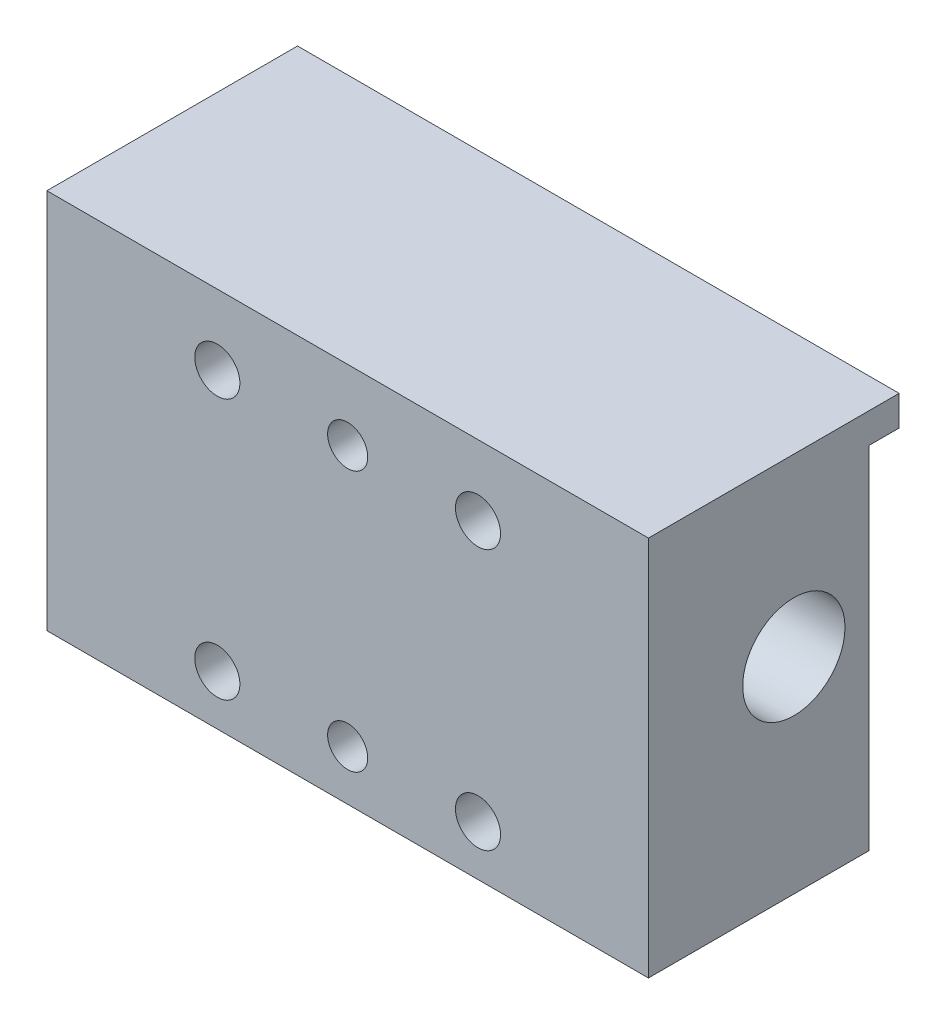
ISO-10303-21;
HEADER;
FILE_DESCRIPTION(('STEP AP214'),'2;1');
FILE_NAME('part.step','',(''),(''),'','','');
FILE_SCHEMA(('AUTOMOTIVE_DESIGN { 1 0 10303 214 1 1 1 1 }'));
ENDSEC;
DATA;
#1=APPLICATION_CONTEXT('core data for automotive mechanical design processes');
#2=APPLICATION_PROTOCOL_DEFINITION('international standard','automotive_design',2000,#1);
#3=PRODUCT_CONTEXT('',#1,'mechanical');
#4=PRODUCT('Part','Part','',(#3));
#5=PRODUCT_RELATED_PRODUCT_CATEGORY('part','',(#4));
#6=PRODUCT_DEFINITION_FORMATION('','',#4);
#7=PRODUCT_DEFINITION_CONTEXT('part definition',#1,'design');
#8=PRODUCT_DEFINITION('design','',#6,#7);
#9=PRODUCT_DEFINITION_SHAPE('','',#8);
#10=(LENGTH_UNIT() NAMED_UNIT(*) SI_UNIT(.MILLI.,.METRE.));
#11=(NAMED_UNIT(*) PLANE_ANGLE_UNIT() SI_UNIT($,.RADIAN.));
#12=(NAMED_UNIT(*) SI_UNIT($,.STERADIAN.) SOLID_ANGLE_UNIT());
#13=UNCERTAINTY_MEASURE_WITH_UNIT(LENGTH_MEASURE(1.E-05),#10,'distance_accuracy_value','');
#14=(GEOMETRIC_REPRESENTATION_CONTEXT(3) GLOBAL_UNCERTAINTY_ASSIGNED_CONTEXT((#13)) GLOBAL_UNIT_ASSIGNED_CONTEXT((#10,
#11,#12)) REPRESENTATION_CONTEXT('',''));
#15=CARTESIAN_POINT('',(0.,0.,0.));
#16=DIRECTION('',(0.,0.,1.));
#17=DIRECTION('',(1.,0.,0.));
#18=AXIS2_PLACEMENT_3D('',#15,#16,#17);
#19=CARTESIAN_POINT('',(0.,0.,22.));
#20=DIRECTION('',(1.,0.,0.));
#21=DIRECTION('',(0.,0.,-1.));
#22=AXIS2_PLACEMENT_3D('',#19,#20,#21);
#23=PLANE('',#22);
#24=CARTESIAN_POINT('',(0.,12.5,7.5));
#25=DIRECTION('',(-1.,0.,0.));
#26=DIRECTION('',(0.,0.,1.));
#27=AXIS2_PLACEMENT_3D('',#24,#25,#26);
#28=CIRCLE('',#27,1.24999999999999);
#29=CARTESIAN_POINT('',(0.,12.5,8.74999999999999));
#30=VERTEX_POINT('',#29);
#31=EDGE_CURVE('E146',#30,#30,#28,.T.);
#32=ORIENTED_EDGE('',*,*,#31,.F.);
#33=EDGE_LOOP('',(#32));
#34=FACE_BOUND('',#33,.T.);
#35=CARTESIAN_POINT('',(0.,28.5,7.5));
#36=DIRECTION('',(-1.,0.,0.));
#37=DIRECTION('',(0.,0.,1.));
#38=AXIS2_PLACEMENT_3D('',#35,#36,#37);
#39=CIRCLE('',#38,1.24999999999999);
#40=CARTESIAN_POINT('',(0.,28.5,8.74999999999999));
#41=VERTEX_POINT('',#40);
#42=EDGE_CURVE('E152',#41,#41,#39,.T.);
#43=ORIENTED_EDGE('',*,*,#42,.F.);
#44=EDGE_LOOP('',(#43));
#45=FACE_BOUND('',#44,.T.);
#46=CARTESIAN_POINT('',(0.,20.5,15.5));
#47=DIRECTION('',(-1.,0.,0.));
#48=DIRECTION('',(0.,0.,1.));
#49=AXIS2_PLACEMENT_3D('',#46,#47,#48);
#50=CIRCLE('',#49,1.24999999999999);
#51=CARTESIAN_POINT('',(0.,20.5,16.75));
#52=VERTEX_POINT('',#51);
#53=EDGE_CURVE('E158',#52,#52,#50,.T.);
#54=ORIENTED_EDGE('',*,*,#53,.F.);
#55=EDGE_LOOP('',(#54));
#56=FACE_BOUND('',#55,.T.);
#57=CARTESIAN_POINT('',(0.,20.5,7.5));
#58=DIRECTION('',(1.,0.,0.));
#59=DIRECTION('',(0.,0.,-1.));
#60=AXIS2_PLACEMENT_3D('',#57,#58,#59);
#61=CIRCLE('',#60,5.1);
#62=CARTESIAN_POINT('',(0.,20.5,2.4));
#63=VERTEX_POINT('',#62);
#64=EDGE_CURVE('E183',#63,#63,#61,.T.);
#65=ORIENTED_EDGE('',*,*,#64,.T.);
#66=EDGE_LOOP('',(#65));
#67=FACE_BOUND('',#66,.T.);
#68=DIRECTION('',(0.,0.,-1.));
#69=VECTOR('',#68,1.);
#70=CARTESIAN_POINT('',(0.,38.,22.));
#71=LINE('',#70,#69);
#72=CARTESIAN_POINT('',(0.,38.,22.));
#73=VERTEX_POINT('',#72);
#74=CARTESIAN_POINT('',(0.,38.,-3.));
#75=VERTEX_POINT('',#74);
#76=EDGE_CURVE('E196',#73,#75,#71,.T.);
#77=ORIENTED_EDGE('',*,*,#76,.T.);
#78=DIRECTION('',(0.,1.,0.));
#79=VECTOR('',#78,1.);
#80=CARTESIAN_POINT('',(0.,35.,-3.));
#81=LINE('',#80,#79);
#82=CARTESIAN_POINT('',(0.,35.,-3.));
#83=VERTEX_POINT('',#82);
#84=EDGE_CURVE('E169',#83,#75,#81,.T.);
#85=ORIENTED_EDGE('',*,*,#84,.F.);
#86=DIRECTION('',(0.,0.,1.));
#87=VECTOR('',#86,1.);
#88=CARTESIAN_POINT('',(0.,35.,-3.));
#89=LINE('',#88,#87);
#90=CARTESIAN_POINT('',(0.,35.,0.));
#91=VERTEX_POINT('',#90);
#92=EDGE_CURVE('E175',#83,#91,#89,.T.);
#93=ORIENTED_EDGE('',*,*,#92,.T.);
#94=DIRECTION('',(0.,-1.,0.));
#95=VECTOR('',#94,1.);
#96=CARTESIAN_POINT('',(0.,0.,0.));
#97=LINE('',#96,#95);
#98=CARTESIAN_POINT('',(0.,0.,0.));
#99=VERTEX_POINT('',#98);
#100=EDGE_CURVE('E186',#91,#99,#97,.T.);
#101=ORIENTED_EDGE('',*,*,#100,.T.);
#102=DIRECTION('',(0.,0.,-1.));
#103=VECTOR('',#102,1.);
#104=CARTESIAN_POINT('',(0.,0.,22.));
#105=LINE('',#104,#103);
#106=CARTESIAN_POINT('',(0.,0.,22.));
#107=VERTEX_POINT('',#106);
#108=EDGE_CURVE('E11',#107,#99,#105,.T.);
#109=ORIENTED_EDGE('',*,*,#108,.F.);
#110=DIRECTION('',(0.,-1.,0.));
#111=VECTOR('',#110,1.);
#112=CARTESIAN_POINT('',(0.,0.,22.));
#113=LINE('',#112,#111);
#114=EDGE_CURVE('E189',#73,#107,#113,.T.);
#115=ORIENTED_EDGE('',*,*,#114,.F.);
#116=EDGE_LOOP('',(#77,#85,#93,#101,#109,#115));
#117=FACE_BOUND('',#116,.T.);
#118=ADVANCED_FACE('F35',(#34,#45,#56,#67,#117),#23,.F.);
#119=CARTESIAN_POINT('',(0.,0.,22.));
#120=DIRECTION('',(0.,1.,0.));
#121=DIRECTION('',(0.,0.,1.));
#122=AXIS2_PLACEMENT_3D('',#119,#120,#121);
#123=PLANE('',#122);
#124=DIRECTION('',(1.,0.,0.));
#125=VECTOR('',#124,1.);
#126=CARTESIAN_POINT('',(0.,0.,0.));
#127=LINE('',#126,#125);
#128=CARTESIAN_POINT('',(60.,0.,0.));
#129=VERTEX_POINT('',#128);
#130=EDGE_CURVE('E75',#99,#129,#127,.T.);
#131=ORIENTED_EDGE('',*,*,#130,.T.);
#132=DIRECTION('',(0.,0.,-1.));
#133=VECTOR('',#132,1.);
#134=CARTESIAN_POINT('',(60.,0.,22.));
#135=LINE('',#134,#133);
#136=CARTESIAN_POINT('',(60.,0.,22.));
#137=VERTEX_POINT('',#136);
#138=EDGE_CURVE('E43',#137,#129,#135,.T.);
#139=ORIENTED_EDGE('',*,*,#138,.F.);
#140=DIRECTION('',(1.,0.,0.));
#141=VECTOR('',#140,1.);
#142=CARTESIAN_POINT('',(0.,0.,22.));
#143=LINE('',#142,#141);
#144=EDGE_CURVE('E80',#107,#137,#143,.T.);
#145=ORIENTED_EDGE('',*,*,#144,.F.);
#146=ORIENTED_EDGE('',*,*,#108,.T.);
#147=EDGE_LOOP('',(#131,#139,#145,#146));
#148=FACE_BOUND('',#147,.T.);
#149=ADVANCED_FACE('F239',(#148),#123,.F.);
#150=CARTESIAN_POINT('',(60.,0.,22.));
#151=DIRECTION('',(-1.,0.,0.));
#152=DIRECTION('',(0.,0.,1.));
#153=AXIS2_PLACEMENT_3D('',#150,#151,#152);
#154=PLANE('',#153);
#155=CARTESIAN_POINT('',(60.,20.5,7.5));
#156=DIRECTION('',(1.,0.,0.));
#157=DIRECTION('',(0.,0.,-1.));
#158=AXIS2_PLACEMENT_3D('',#155,#156,#157);
#159=CIRCLE('',#158,5.1);
#160=CARTESIAN_POINT('',(60.,20.5,2.4));
#161=VERTEX_POINT('',#160);
#162=EDGE_CURVE('E182',#161,#161,#159,.T.);
#163=ORIENTED_EDGE('',*,*,#162,.F.);
#164=EDGE_LOOP('',(#163));
#165=FACE_BOUND('',#164,.T.);
#166=DIRECTION('',(0.,1.,0.));
#167=VECTOR('',#166,1.);
#168=CARTESIAN_POINT('',(60.,0.,0.));
#169=LINE('',#168,#167);
#170=CARTESIAN_POINT('',(60.,35.,0.));
#171=VERTEX_POINT('',#170);
#172=EDGE_CURVE('E191',#129,#171,#169,.T.);
#173=ORIENTED_EDGE('',*,*,#172,.T.);
#174=DIRECTION('',(0.,0.,1.));
#175=VECTOR('',#174,1.);
#176=CARTESIAN_POINT('',(60.,35.,-3.));
#177=LINE('',#176,#175);
#178=CARTESIAN_POINT('',(60.,35.,-3.));
#179=VERTEX_POINT('',#178);
#180=EDGE_CURVE('E179',#179,#171,#177,.T.);
#181=ORIENTED_EDGE('',*,*,#180,.F.);
#182=DIRECTION('',(0.,-1.,0.));
#183=VECTOR('',#182,1.);
#184=CARTESIAN_POINT('',(60.,35.,-3.));
#185=LINE('',#184,#183);
#186=CARTESIAN_POINT('',(60.,38.,-3.));
#187=VERTEX_POINT('',#186);
#188=EDGE_CURVE('E164',#187,#179,#185,.T.);
#189=ORIENTED_EDGE('',*,*,#188,.F.);
#190=DIRECTION('',(0.,0.,-1.));
#191=VECTOR('',#190,1.);
#192=CARTESIAN_POINT('',(60.,38.,22.));
#193=LINE('',#192,#191);
#194=CARTESIAN_POINT('',(60.,38.,22.));
#195=VERTEX_POINT('',#194);
#196=EDGE_CURVE('E201',#195,#187,#193,.T.);
#197=ORIENTED_EDGE('',*,*,#196,.F.);
#198=DIRECTION('',(0.,1.,0.));
#199=VECTOR('',#198,1.);
#200=CARTESIAN_POINT('',(60.,0.,22.));
#201=LINE('',#200,#199);
#202=EDGE_CURVE('E193',#137,#195,#201,.T.);
#203=ORIENTED_EDGE('',*,*,#202,.F.);
#204=ORIENTED_EDGE('',*,*,#138,.T.);
#205=EDGE_LOOP('',(#173,#181,#189,#197,#203,#204));
#206=FACE_BOUND('',#205,.T.);
#207=ADVANCED_FACE('F241',(#165,#206),#154,.F.);
#208=CARTESIAN_POINT('',(0.,38.,22.));
#209=DIRECTION('',(0.,-1.,0.));
#210=DIRECTION('',(0.,0.,-1.));
#211=AXIS2_PLACEMENT_3D('',#208,#209,#210);
#212=PLANE('',#211);
#213=ORIENTED_EDGE('',*,*,#196,.T.);
#214=DIRECTION('',(1.,0.,0.));
#215=VECTOR('',#214,1.);
#216=CARTESIAN_POINT('',(60.,38.,-3.));
#217=LINE('',#216,#215);
#218=EDGE_CURVE('E172',#75,#187,#217,.T.);
#219=ORIENTED_EDGE('',*,*,#218,.F.);
#220=ORIENTED_EDGE('',*,*,#76,.F.);
#221=DIRECTION('',(-1.,0.,0.));
#222=VECTOR('',#221,1.);
#223=CARTESIAN_POINT('',(0.,38.,22.));
#224=LINE('',#223,#222);
#225=EDGE_CURVE('E60',#195,#73,#224,.T.);
#226=ORIENTED_EDGE('',*,*,#225,.F.);
#227=EDGE_LOOP('',(#213,#219,#220,#226));
#228=FACE_BOUND('',#227,.T.);
#229=ADVANCED_FACE('F233',(#228),#212,.F.);
#230=CARTESIAN_POINT('',(0.,0.,22.));
#231=DIRECTION('',(0.,0.,-1.));
#232=DIRECTION('',(-1.,0.,0.));
#233=AXIS2_PLACEMENT_3D('',#230,#231,#232);
#234=PLANE('',#233);
#235=CARTESIAN_POINT('',(30.,31.,22.));
#236=DIRECTION('',(0.,0.,1.));
#237=DIRECTION('',(1.,0.,0.));
#238=AXIS2_PLACEMENT_3D('',#235,#236,#237);
#239=CIRCLE('',#238,1.99999999999999);
#240=CARTESIAN_POINT('',(32.,31.,22.));
#241=VERTEX_POINT('',#240);
#242=EDGE_CURVE('E121',#241,#241,#239,.T.);
#243=ORIENTED_EDGE('',*,*,#242,.F.);
#244=EDGE_LOOP('',(#243));
#245=FACE_BOUND('',#244,.T.);
#246=CARTESIAN_POINT('',(30.,5.,22.));
#247=DIRECTION('',(0.,0.,1.));
#248=DIRECTION('',(1.,0.,0.));
#249=AXIS2_PLACEMENT_3D('',#246,#247,#248);
#250=CIRCLE('',#249,1.99999999999999);
#251=CARTESIAN_POINT('',(32.,5.,22.));
#252=VERTEX_POINT('',#251);
#253=EDGE_CURVE('E120',#252,#252,#250,.T.);
#254=ORIENTED_EDGE('',*,*,#253,.F.);
#255=EDGE_LOOP('',(#254));
#256=FACE_BOUND('',#255,.T.);
#257=CARTESIAN_POINT('',(17.,5.,22.));
#258=DIRECTION('',(0.,0.,1.));
#259=DIRECTION('',(1.,0.,0.));
#260=AXIS2_PLACEMENT_3D('',#257,#258,#259);
#261=CIRCLE('',#260,2.24999999999999);
#262=CARTESIAN_POINT('',(19.25,5.,22.));
#263=VERTEX_POINT('',#262);
#264=EDGE_CURVE('E131',#263,#263,#261,.T.);
#265=ORIENTED_EDGE('',*,*,#264,.F.);
#266=EDGE_LOOP('',(#265));
#267=FACE_BOUND('',#266,.T.);
#268=CARTESIAN_POINT('',(43.,31.,22.));
#269=DIRECTION('',(0.,0.,1.));
#270=DIRECTION('',(1.,0.,0.));
#271=AXIS2_PLACEMENT_3D('',#268,#269,#270);
#272=CIRCLE('',#271,2.24999999999999);
#273=CARTESIAN_POINT('',(45.25,31.,22.));
#274=VERTEX_POINT('',#273);
#275=EDGE_CURVE('E134',#274,#274,#272,.T.);
#276=ORIENTED_EDGE('',*,*,#275,.F.);
#277=EDGE_LOOP('',(#276));
#278=FACE_BOUND('',#277,.T.);
#279=CARTESIAN_POINT('',(43.,5.,22.));
#280=DIRECTION('',(0.,0.,1.));
#281=DIRECTION('',(1.,0.,0.));
#282=AXIS2_PLACEMENT_3D('',#279,#280,#281);
#283=CIRCLE('',#282,2.24999999999999);
#284=CARTESIAN_POINT('',(45.25,5.,22.));
#285=VERTEX_POINT('',#284);
#286=EDGE_CURVE('E138',#285,#285,#283,.T.);
#287=ORIENTED_EDGE('',*,*,#286,.F.);
#288=EDGE_LOOP('',(#287));
#289=FACE_BOUND('',#288,.T.);
#290=CARTESIAN_POINT('',(17.,31.,22.));
#291=DIRECTION('',(0.,0.,1.));
#292=DIRECTION('',(1.,0.,0.));
#293=AXIS2_PLACEMENT_3D('',#290,#291,#292);
#294=CIRCLE('',#293,2.24999999999999);
#295=CARTESIAN_POINT('',(19.25,31.,22.));
#296=VERTEX_POINT('',#295);
#297=EDGE_CURVE('E142',#296,#296,#294,.T.);
#298=ORIENTED_EDGE('',*,*,#297,.F.);
#299=EDGE_LOOP('',(#298));
#300=FACE_BOUND('',#299,.T.);
#301=ORIENTED_EDGE('',*,*,#114,.T.);
#302=ORIENTED_EDGE('',*,*,#144,.T.);
#303=ORIENTED_EDGE('',*,*,#202,.T.);
#304=ORIENTED_EDGE('',*,*,#225,.T.);
#305=EDGE_LOOP('',(#301,#302,#303,#304));
#306=FACE_BOUND('',#305,.T.);
#307=ADVANCED_FACE('F217',(#245,#256,#267,#278,#289,#300,#306),#234,.F.);
#308=CARTESIAN_POINT('',(0.,0.,0.));
#309=DIRECTION('',(0.,0.,-1.));
#310=DIRECTION('',(-1.,0.,0.));
#311=AXIS2_PLACEMENT_3D('',#308,#309,#310);
#312=PLANE('',#311);
#313=CARTESIAN_POINT('',(17.,5.,0.));
#314=DIRECTION('',(0.,0.,-1.));
#315=DIRECTION('',(-1.,0.,0.));
#316=AXIS2_PLACEMENT_3D('',#313,#314,#315);
#317=CIRCLE('',#316,2.24999999999999);
#318=CARTESIAN_POINT('',(14.75,5.,0.));
#319=VERTEX_POINT('',#318);
#320=EDGE_CURVE('E38',#319,#319,#317,.T.);
#321=ORIENTED_EDGE('',*,*,#320,.F.);
#322=EDGE_LOOP('',(#321));
#323=FACE_BOUND('',#322,.T.);
#324=CARTESIAN_POINT('',(43.,31.,0.));
#325=DIRECTION('',(0.,0.,-1.));
#326=DIRECTION('',(-1.,0.,0.));
#327=AXIS2_PLACEMENT_3D('',#324,#325,#326);
#328=CIRCLE('',#327,2.24999999999999);
#329=CARTESIAN_POINT('',(40.75,31.,0.));
#330=VERTEX_POINT('',#329);
#331=EDGE_CURVE('E137',#330,#330,#328,.T.);
#332=ORIENTED_EDGE('',*,*,#331,.F.);
#333=EDGE_LOOP('',(#332));
#334=FACE_BOUND('',#333,.T.);
#335=CARTESIAN_POINT('',(43.,5.,0.));
#336=DIRECTION('',(0.,0.,-1.));
#337=DIRECTION('',(-1.,0.,0.));
#338=AXIS2_PLACEMENT_3D('',#335,#336,#337);
#339=CIRCLE('',#338,2.24999999999999);
#340=CARTESIAN_POINT('',(40.75,5.,0.));
#341=VERTEX_POINT('',#340);
#342=EDGE_CURVE('E141',#341,#341,#339,.T.);
#343=ORIENTED_EDGE('',*,*,#342,.F.);
#344=EDGE_LOOP('',(#343));
#345=FACE_BOUND('',#344,.T.);
#346=CARTESIAN_POINT('',(17.,31.,0.));
#347=DIRECTION('',(0.,0.,-1.));
#348=DIRECTION('',(-1.,0.,0.));
#349=AXIS2_PLACEMENT_3D('',#346,#347,#348);
#350=CIRCLE('',#349,2.24999999999999);
#351=CARTESIAN_POINT('',(14.75,31.,0.));
#352=VERTEX_POINT('',#351);
#353=EDGE_CURVE('E145',#352,#352,#350,.T.);
#354=ORIENTED_EDGE('',*,*,#353,.F.);
#355=EDGE_LOOP('',(#354));
#356=FACE_BOUND('',#355,.T.);
#357=DIRECTION('',(-1.,0.,0.));
#358=VECTOR('',#357,1.);
#359=CARTESIAN_POINT('',(60.,35.,0.));
#360=LINE('',#359,#358);
#361=EDGE_CURVE('E51',#171,#91,#360,.T.);
#362=ORIENTED_EDGE('',*,*,#361,.F.);
#363=ORIENTED_EDGE('',*,*,#172,.F.);
#364=ORIENTED_EDGE('',*,*,#130,.F.);
#365=ORIENTED_EDGE('',*,*,#100,.F.);
#366=EDGE_LOOP('',(#362,#363,#364,#365));
#367=FACE_BOUND('',#366,.T.);
#368=ADVANCED_FACE('F213',(#323,#334,#345,#356,#367),#312,.T.);
#369=CARTESIAN_POINT('',(0.,20.5,7.5));
#370=DIRECTION('',(1.,0.,0.));
#371=DIRECTION('',(0.,0.,-1.));
#372=AXIS2_PLACEMENT_3D('',#369,#370,#371);
#373=CYLINDRICAL_SURFACE('',#372,5.1);
#374=ORIENTED_EDGE('',*,*,#64,.F.);
#375=EDGE_LOOP('',(#374));
#376=FACE_BOUND('',#375,.T.);
#377=ORIENTED_EDGE('',*,*,#162,.T.);
#378=EDGE_LOOP('',(#377));
#379=FACE_BOUND('',#378,.T.);
#380=ADVANCED_FACE('F216',(#376,#379),#373,.F.);
#381=CARTESIAN_POINT('',(60.,35.,-3.));
#382=DIRECTION('',(0.,1.,0.));
#383=DIRECTION('',(0.,0.,1.));
#384=AXIS2_PLACEMENT_3D('',#381,#382,#383);
#385=PLANE('',#384);
#386=ORIENTED_EDGE('',*,*,#361,.T.);
#387=ORIENTED_EDGE('',*,*,#92,.F.);
#388=DIRECTION('',(-1.,0.,0.));
#389=VECTOR('',#388,1.);
#390=CARTESIAN_POINT('',(60.,35.,-3.));
#391=LINE('',#390,#389);
#392=EDGE_CURVE('E167',#179,#83,#391,.T.);
#393=ORIENTED_EDGE('',*,*,#392,.F.);
#394=ORIENTED_EDGE('',*,*,#180,.T.);
#395=EDGE_LOOP('',(#386,#387,#393,#394));
#396=FACE_BOUND('',#395,.T.);
#397=ADVANCED_FACE('F255',(#396),#385,.F.);
#398=CARTESIAN_POINT('',(0.,0.,-3.));
#399=DIRECTION('',(0.,0.,1.));
#400=DIRECTION('',(1.,0.,0.));
#401=AXIS2_PLACEMENT_3D('',#398,#399,#400);
#402=PLANE('',#401);
#403=ORIENTED_EDGE('',*,*,#188,.T.);
#404=ORIENTED_EDGE('',*,*,#392,.T.);
#405=ORIENTED_EDGE('',*,*,#84,.T.);
#406=ORIENTED_EDGE('',*,*,#218,.T.);
#407=EDGE_LOOP('',(#403,#404,#405,#406));
#408=FACE_BOUND('',#407,.T.);
#409=ADVANCED_FACE('F259',(#408),#402,.F.);
#410=CARTESIAN_POINT('',(14.,20.5,15.5));
#411=DIRECTION('',(-1.,0.,0.));
#412=DIRECTION('',(0.,0.,1.));
#413=AXIS2_PLACEMENT_3D('',#410,#411,#412);
#414=CONICAL_SURFACE('',#413,1.24999999999999,1.02974425867665);
#415=CARTESIAN_POINT('',(14.7510757737845,20.5,15.5));
#416=VERTEX_POINT('',#415);
#417=VERTEX_LOOP('',#416);
#418=FACE_BOUND('',#417,.T.);
#419=CARTESIAN_POINT('',(14.,20.5,15.5));
#420=DIRECTION('',(-1.,0.,0.));
#421=DIRECTION('',(0.,0.,1.));
#422=AXIS2_PLACEMENT_3D('',#419,#420,#421);
#423=CIRCLE('',#422,1.24999999999999);
#424=CARTESIAN_POINT('',(14.,20.5,16.75));
#425=VERTEX_POINT('',#424);
#426=EDGE_CURVE('E161',#425,#425,#423,.T.);
#427=ORIENTED_EDGE('',*,*,#426,.T.);
#428=EDGE_LOOP('',(#427));
#429=FACE_BOUND('',#428,.T.);
#430=ADVANCED_FACE('F263',(#418,#429),#414,.F.);
#431=CARTESIAN_POINT('',(0.,20.5,15.5));
#432=DIRECTION('',(-1.,0.,0.));
#433=DIRECTION('',(0.,0.,1.));
#434=AXIS2_PLACEMENT_3D('',#431,#432,#433);
#435=CYLINDRICAL_SURFACE('',#434,1.24999999999999);
#436=ORIENTED_EDGE('',*,*,#426,.F.);
#437=EDGE_LOOP('',(#436));
#438=FACE_BOUND('',#437,.T.);
#439=ORIENTED_EDGE('',*,*,#53,.T.);
#440=EDGE_LOOP('',(#439));
#441=FACE_BOUND('',#440,.T.);
#442=ADVANCED_FACE('F267',(#438,#441),#435,.F.);
#443=CARTESIAN_POINT('',(14.,28.5,7.5));
#444=DIRECTION('',(-1.,0.,0.));
#445=DIRECTION('',(0.,0.,1.));
#446=AXIS2_PLACEMENT_3D('',#443,#444,#445);
#447=CONICAL_SURFACE('',#446,1.24999999999999,1.02974425867665);
#448=CARTESIAN_POINT('',(14.7510757737845,28.5,7.5));
#449=VERTEX_POINT('',#448);
#450=VERTEX_LOOP('',#449);
#451=FACE_BOUND('',#450,.T.);
#452=CARTESIAN_POINT('',(14.,28.5,7.5));
#453=DIRECTION('',(-1.,0.,0.));
#454=DIRECTION('',(0.,0.,1.));
#455=AXIS2_PLACEMENT_3D('',#452,#453,#454);
#456=CIRCLE('',#455,1.24999999999999);
#457=CARTESIAN_POINT('',(14.,28.5,8.74999999999999));
#458=VERTEX_POINT('',#457);
#459=EDGE_CURVE('E155',#458,#458,#456,.T.);
#460=ORIENTED_EDGE('',*,*,#459,.T.);
#461=EDGE_LOOP('',(#460));
#462=FACE_BOUND('',#461,.T.);
#463=ADVANCED_FACE('F271',(#451,#462),#447,.F.);
#464=CARTESIAN_POINT('',(0.,28.5,7.5));
#465=DIRECTION('',(-1.,0.,0.));
#466=DIRECTION('',(0.,0.,1.));
#467=AXIS2_PLACEMENT_3D('',#464,#465,#466);
#468=CYLINDRICAL_SURFACE('',#467,1.24999999999999);
#469=ORIENTED_EDGE('',*,*,#459,.F.);
#470=EDGE_LOOP('',(#469));
#471=FACE_BOUND('',#470,.T.);
#472=ORIENTED_EDGE('',*,*,#42,.T.);
#473=EDGE_LOOP('',(#472));
#474=FACE_BOUND('',#473,.T.);
#475=ADVANCED_FACE('F275',(#471,#474),#468,.F.);
#476=CARTESIAN_POINT('',(14.,12.5,7.5));
#477=DIRECTION('',(-1.,0.,0.));
#478=DIRECTION('',(0.,0.,1.));
#479=AXIS2_PLACEMENT_3D('',#476,#477,#478);
#480=CONICAL_SURFACE('',#479,1.24999999999999,1.02974425867665);
#481=CARTESIAN_POINT('',(14.7510757737845,12.5,7.5));
#482=VERTEX_POINT('',#481);
#483=VERTEX_LOOP('',#482);
#484=FACE_BOUND('',#483,.T.);
#485=CARTESIAN_POINT('',(14.,12.5,7.5));
#486=DIRECTION('',(-1.,0.,0.));
#487=DIRECTION('',(0.,0.,1.));
#488=AXIS2_PLACEMENT_3D('',#485,#486,#487);
#489=CIRCLE('',#488,1.24999999999999);
#490=CARTESIAN_POINT('',(14.,12.5,8.74999999999999));
#491=VERTEX_POINT('',#490);
#492=EDGE_CURVE('E149',#491,#491,#489,.T.);
#493=ORIENTED_EDGE('',*,*,#492,.T.);
#494=EDGE_LOOP('',(#493));
#495=FACE_BOUND('',#494,.T.);
#496=ADVANCED_FACE('F279',(#484,#495),#480,.F.);
#497=CARTESIAN_POINT('',(0.,12.5,7.5));
#498=DIRECTION('',(-1.,0.,0.));
#499=DIRECTION('',(0.,0.,1.));
#500=AXIS2_PLACEMENT_3D('',#497,#498,#499);
#501=CYLINDRICAL_SURFACE('',#500,1.24999999999999);
#502=ORIENTED_EDGE('',*,*,#492,.F.);
#503=EDGE_LOOP('',(#502));
#504=FACE_BOUND('',#503,.T.);
#505=ORIENTED_EDGE('',*,*,#31,.T.);
#506=EDGE_LOOP('',(#505));
#507=FACE_BOUND('',#506,.T.);
#508=ADVANCED_FACE('F228',(#504,#507),#501,.F.);
#509=CARTESIAN_POINT('',(17.,31.,22.));
#510=DIRECTION('',(0.,0.,1.));
#511=DIRECTION('',(1.,0.,0.));
#512=AXIS2_PLACEMENT_3D('',#509,#510,#511);
#513=CYLINDRICAL_SURFACE('',#512,2.24999999999999);
#514=ORIENTED_EDGE('',*,*,#353,.T.);
#515=EDGE_LOOP('',(#514));
#516=FACE_BOUND('',#515,.T.);
#517=ORIENTED_EDGE('',*,*,#297,.T.);
#518=EDGE_LOOP('',(#517));
#519=FACE_BOUND('',#518,.T.);
#520=ADVANCED_FACE('F224',(#516,#519),#513,.F.);
#521=CARTESIAN_POINT('',(43.,5.,22.));
#522=DIRECTION('',(0.,0.,1.));
#523=DIRECTION('',(1.,0.,0.));
#524=AXIS2_PLACEMENT_3D('',#521,#522,#523);
#525=CYLINDRICAL_SURFACE('',#524,2.24999999999999);
#526=ORIENTED_EDGE('',*,*,#342,.T.);
#527=EDGE_LOOP('',(#526));
#528=FACE_BOUND('',#527,.T.);
#529=ORIENTED_EDGE('',*,*,#286,.T.);
#530=EDGE_LOOP('',(#529));
#531=FACE_BOUND('',#530,.T.);
#532=ADVANCED_FACE('F227',(#528,#531),#525,.F.);
#533=CARTESIAN_POINT('',(43.,31.,22.));
#534=DIRECTION('',(0.,0.,1.));
#535=DIRECTION('',(1.,0.,0.));
#536=AXIS2_PLACEMENT_3D('',#533,#534,#535);
#537=CYLINDRICAL_SURFACE('',#536,2.24999999999999);
#538=ORIENTED_EDGE('',*,*,#331,.T.);
#539=EDGE_LOOP('',(#538));
#540=FACE_BOUND('',#539,.T.);
#541=ORIENTED_EDGE('',*,*,#275,.T.);
#542=EDGE_LOOP('',(#541));
#543=FACE_BOUND('',#542,.T.);
#544=ADVANCED_FACE('F210',(#540,#543),#537,.F.);
#545=CARTESIAN_POINT('',(17.,5.,22.));
#546=DIRECTION('',(0.,0.,1.));
#547=DIRECTION('',(1.,0.,0.));
#548=AXIS2_PLACEMENT_3D('',#545,#546,#547);
#549=CYLINDRICAL_SURFACE('',#548,2.24999999999999);
#550=ORIENTED_EDGE('',*,*,#320,.T.);
#551=EDGE_LOOP('',(#550));
#552=FACE_BOUND('',#551,.T.);
#553=ORIENTED_EDGE('',*,*,#264,.T.);
#554=EDGE_LOOP('',(#553));
#555=FACE_BOUND('',#554,.T.);
#556=ADVANCED_FACE('F292',(#552,#555),#549,.F.);
#557=CARTESIAN_POINT('',(30.,5.,8.));
#558=DIRECTION('',(0.,0.,1.));
#559=DIRECTION('',(1.,0.,0.));
#560=AXIS2_PLACEMENT_3D('',#557,#558,#559);
#561=CONICAL_SURFACE('',#560,1.99999999999999,1.02974425867665);
#562=CARTESIAN_POINT('',(30.,5.,6.79827876194488));
#563=VERTEX_POINT('',#562);
#564=VERTEX_LOOP('',#563);
#565=FACE_BOUND('',#564,.T.);
#566=CARTESIAN_POINT('',(30.,5.,8.));
#567=DIRECTION('',(0.,0.,1.));
#568=DIRECTION('',(1.,0.,0.));
#569=AXIS2_PLACEMENT_3D('',#566,#567,#568);
#570=CIRCLE('',#569,1.99999999999999);
#571=CARTESIAN_POINT('',(32.,5.,8.));
#572=VERTEX_POINT('',#571);
#573=EDGE_CURVE('E124',#572,#572,#570,.T.);
#574=ORIENTED_EDGE('',*,*,#573,.T.);
#575=EDGE_LOOP('',(#574));
#576=FACE_BOUND('',#575,.T.);
#577=ADVANCED_FACE('F295',(#565,#576),#561,.F.);
#578=CARTESIAN_POINT('',(30.,5.,22.));
#579=DIRECTION('',(0.,0.,1.));
#580=DIRECTION('',(1.,0.,0.));
#581=AXIS2_PLACEMENT_3D('',#578,#579,#580);
#582=CYLINDRICAL_SURFACE('',#581,1.99999999999999);
#583=ORIENTED_EDGE('',*,*,#573,.F.);
#584=EDGE_LOOP('',(#583));
#585=FACE_BOUND('',#584,.T.);
#586=ORIENTED_EDGE('',*,*,#253,.T.);
#587=EDGE_LOOP('',(#586));
#588=FACE_BOUND('',#587,.T.);
#589=ADVANCED_FACE('F114',(#585,#588),#582,.F.);
#590=CARTESIAN_POINT('',(30.,31.,8.));
#591=DIRECTION('',(0.,0.,1.));
#592=DIRECTION('',(1.,0.,0.));
#593=AXIS2_PLACEMENT_3D('',#590,#591,#592);
#594=CONICAL_SURFACE('',#593,1.99999999999999,1.02974425867665);
#595=CARTESIAN_POINT('',(30.,31.,6.79827876194488));
#596=VERTEX_POINT('',#595);
#597=VERTEX_LOOP('',#596);
#598=FACE_BOUND('',#597,.T.);
#599=CARTESIAN_POINT('',(30.,31.,8.));
#600=DIRECTION('',(0.,0.,1.));
#601=DIRECTION('',(1.,0.,0.));
#602=AXIS2_PLACEMENT_3D('',#599,#600,#601);
#603=CIRCLE('',#602,1.99999999999999);
#604=CARTESIAN_POINT('',(32.,31.,8.));
#605=VERTEX_POINT('',#604);
#606=EDGE_CURVE('E118',#605,#605,#603,.T.);
#607=ORIENTED_EDGE('',*,*,#606,.T.);
#608=EDGE_LOOP('',(#607));
#609=FACE_BOUND('',#608,.T.);
#610=ADVANCED_FACE('F110',(#598,#609),#594,.F.);
#611=CARTESIAN_POINT('',(30.,31.,22.));
#612=DIRECTION('',(0.,0.,1.));
#613=DIRECTION('',(1.,0.,0.));
#614=AXIS2_PLACEMENT_3D('',#611,#612,#613);
#615=CYLINDRICAL_SURFACE('',#614,1.99999999999999);
#616=ORIENTED_EDGE('',*,*,#606,.F.);
#617=EDGE_LOOP('',(#616));
#618=FACE_BOUND('',#617,.T.);
#619=ORIENTED_EDGE('',*,*,#242,.T.);
#620=EDGE_LOOP('',(#619));
#621=FACE_BOUND('',#620,.T.);
#622=ADVANCED_FACE('F113',(#618,#621),#615,.F.);
#623=CLOSED_SHELL('',(#118,#149,#207,#229,#307,#368,#380,#397,#409,#430,#442,#463,#475,#496,
#508,#520,#532,#544,#556,#577,#589,#610,#622));
#624=MANIFOLD_SOLID_BREP('B2',#623);
#625=ADVANCED_BREP_SHAPE_REPRESENTATION('',(#18,#624),#14);
#626=SHAPE_DEFINITION_REPRESENTATION(#9,#625);
ENDSEC;
END-ISO-10303-21;
